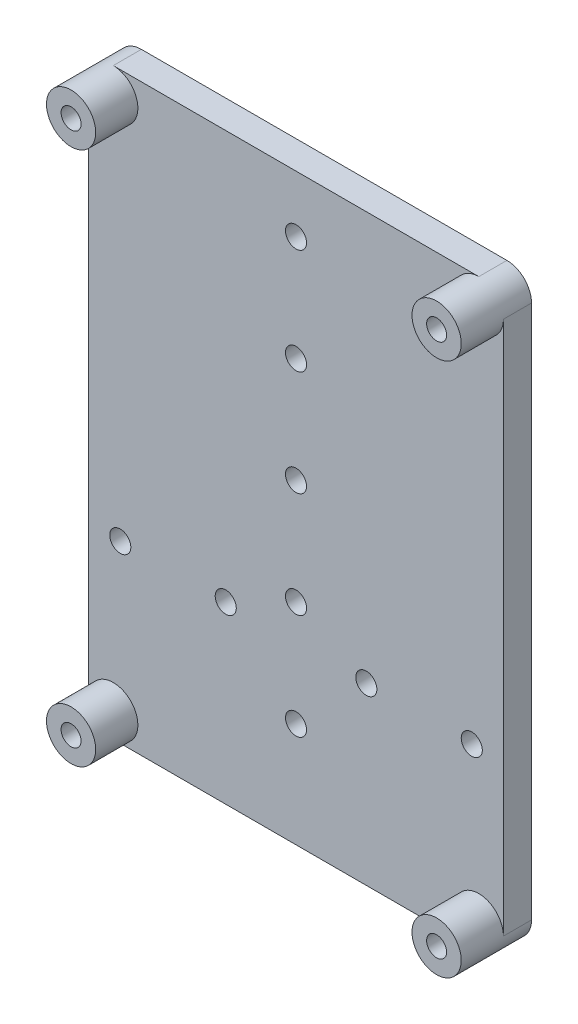
ISO-10303-21;
HEADER;
FILE_DESCRIPTION(('STEP AP214'),'2;1');
FILE_NAME('part.step','',(''),(''),'','','');
FILE_SCHEMA(('AUTOMOTIVE_DESIGN { 1 0 10303 214 1 1 1 1 }'));
ENDSEC;
DATA;
#1=APPLICATION_CONTEXT('core data for automotive mechanical design processes');
#2=APPLICATION_PROTOCOL_DEFINITION('international standard','automotive_design',2000,#1);
#3=PRODUCT_CONTEXT('',#1,'mechanical');
#4=PRODUCT('Part','Part','',(#3));
#5=PRODUCT_RELATED_PRODUCT_CATEGORY('part','',(#4));
#6=PRODUCT_DEFINITION_FORMATION('','',#4);
#7=PRODUCT_DEFINITION_CONTEXT('part definition',#1,'design');
#8=PRODUCT_DEFINITION('design','',#6,#7);
#9=PRODUCT_DEFINITION_SHAPE('','',#8);
#10=(LENGTH_UNIT() NAMED_UNIT(*) SI_UNIT(.MILLI.,.METRE.));
#11=(NAMED_UNIT(*) PLANE_ANGLE_UNIT() SI_UNIT($,.RADIAN.));
#12=(NAMED_UNIT(*) SI_UNIT($,.STERADIAN.) SOLID_ANGLE_UNIT());
#13=UNCERTAINTY_MEASURE_WITH_UNIT(LENGTH_MEASURE(1.E-05),#10,'distance_accuracy_value','');
#14=(GEOMETRIC_REPRESENTATION_CONTEXT(3) GLOBAL_UNCERTAINTY_ASSIGNED_CONTEXT((#13)) GLOBAL_UNIT_ASSIGNED_CONTEXT((#10,
#11,#12)) REPRESENTATION_CONTEXT('',''));
#15=CARTESIAN_POINT('',(0.,0.,0.));
#16=DIRECTION('',(0.,0.,1.));
#17=DIRECTION('',(1.,0.,0.));
#18=AXIS2_PLACEMENT_3D('',#15,#16,#17);
#19=CARTESIAN_POINT('',(108.526557276723,189.230165260636,193.266714262562));
#20=DIRECTION('',(0.,0.,1.));
#21=DIRECTION('',(1.,0.,0.));
#22=AXIS2_PLACEMENT_3D('',#19,#20,#21);
#23=PLANE('',#22);
#24=DIRECTION('',(0.,1.,0.));
#25=VECTOR('',#24,1.);
#26=CARTESIAN_POINT('',(105.026557276723,189.230165260636,193.266714262562));
#27=LINE('',#26,#25);
#28=CARTESIAN_POINT('',(105.026557276723,189.230165260636,193.266714262562));
#29=VERTEX_POINT('',#28);
#30=CARTESIAN_POINT('',(105.026557276723,113.230165260636,193.266714262562));
#31=VERTEX_POINT('',#30);
#32=EDGE_CURVE('E120',#29,#31,#27,.F.);
#33=ORIENTED_EDGE('',*,*,#32,.T.);
#34=CARTESIAN_POINT('',(108.526557276723,113.230165260636,193.266714262562));
#35=DIRECTION('',(0.,0.,-1.));
#36=DIRECTION('',(-1.,0.,0.));
#37=AXIS2_PLACEMENT_3D('',#34,#35,#36);
#38=CIRCLE('',#37,3.50000000000002);
#39=CARTESIAN_POINT('',(108.526557276723,109.730165260636,193.266714262562));
#40=VERTEX_POINT('',#39);
#41=EDGE_CURVE('E117',#40,#31,#38,.F.);
#42=ORIENTED_EDGE('',*,*,#41,.F.);
#43=DIRECTION('',(-1.,0.,0.));
#44=VECTOR('',#43,1.);
#45=CARTESIAN_POINT('',(108.526557276723,109.730165260636,193.266714262562));
#46=LINE('',#45,#44);
#47=CARTESIAN_POINT('',(160.526557276723,109.730165260636,193.266714262562));
#48=VERTEX_POINT('',#47);
#49=EDGE_CURVE('E90',#40,#48,#46,.F.);
#50=ORIENTED_EDGE('',*,*,#49,.T.);
#51=CARTESIAN_POINT('',(160.526557276723,113.230165260636,193.266714262562));
#52=DIRECTION('',(0.,0.,-1.));
#53=DIRECTION('',(-1.,0.,0.));
#54=AXIS2_PLACEMENT_3D('',#51,#52,#53);
#55=CIRCLE('',#54,3.5);
#56=CARTESIAN_POINT('',(164.026557276723,113.230165260636,193.266714262562));
#57=VERTEX_POINT('',#56);
#58=EDGE_CURVE('E83',#57,#48,#55,.F.);
#59=ORIENTED_EDGE('',*,*,#58,.F.);
#60=DIRECTION('',(0.,-1.,0.));
#61=VECTOR('',#60,1.);
#62=CARTESIAN_POINT('',(164.026557276723,113.230165260636,193.266714262562));
#63=LINE('',#62,#61);
#64=CARTESIAN_POINT('',(164.026557276723,189.230165260636,193.266714262562));
#65=VERTEX_POINT('',#64);
#66=EDGE_CURVE('E87',#57,#65,#63,.F.);
#67=ORIENTED_EDGE('',*,*,#66,.T.);
#68=CARTESIAN_POINT('',(160.526557276723,189.230165260636,193.266714262562));
#69=DIRECTION('',(0.,0.,-1.));
#70=DIRECTION('',(-1.,0.,0.));
#71=AXIS2_PLACEMENT_3D('',#68,#69,#70);
#72=CIRCLE('',#71,3.5);
#73=CARTESIAN_POINT('',(160.526557276723,192.730165260636,193.266714262562));
#74=VERTEX_POINT('',#73);
#75=EDGE_CURVE('E78',#74,#65,#72,.F.);
#76=ORIENTED_EDGE('',*,*,#75,.F.);
#77=DIRECTION('',(1.,0.,0.));
#78=VECTOR('',#77,1.);
#79=CARTESIAN_POINT('',(160.526557276723,192.730165260636,193.266714262562));
#80=LINE('',#79,#78);
#81=CARTESIAN_POINT('',(108.526557276723,192.730165260636,193.266714262562));
#82=VERTEX_POINT('',#81);
#83=EDGE_CURVE('E122',#74,#82,#80,.F.);
#84=ORIENTED_EDGE('',*,*,#83,.T.);
#85=CARTESIAN_POINT('',(108.526557276723,189.230165260636,193.266714262562));
#86=DIRECTION('',(0.,0.,-1.));
#87=DIRECTION('',(-1.,0.,0.));
#88=AXIS2_PLACEMENT_3D('',#85,#86,#87);
#89=CIRCLE('',#88,3.5);
#90=EDGE_CURVE('E216',#29,#82,#89,.F.);
#91=ORIENTED_EDGE('',*,*,#90,.F.);
#92=EDGE_LOOP('',(#33,#42,#50,#59,#67,#76,#84,#91));
#93=FACE_BOUND('',#92,.T.);
#94=CARTESIAN_POINT('',(134.526557276723,169.637085274738,193.266714262562));
#95=DIRECTION('',(0.,0.,-1.));
#96=DIRECTION('',(-1.,0.,0.));
#97=AXIS2_PLACEMENT_3D('',#94,#95,#96);
#98=CIRCLE('',#97,1.5);
#99=CARTESIAN_POINT('',(133.026557276723,169.637085274738,193.266714262562));
#100=VERTEX_POINT('',#99);
#101=EDGE_CURVE('E191',#100,#100,#98,.T.);
#102=ORIENTED_EDGE('',*,*,#101,.T.);
#103=EDGE_LOOP('',(#102));
#104=FACE_BOUND('',#103,.T.);
#105=CARTESIAN_POINT('',(134.526557276723,139.637085274738,193.266714262562));
#106=DIRECTION('',(0.,0.,-1.));
#107=DIRECTION('',(-1.,0.,0.));
#108=AXIS2_PLACEMENT_3D('',#105,#106,#107);
#109=CIRCLE('',#108,1.5);
#110=CARTESIAN_POINT('',(133.026557276723,139.637085274738,193.266714262562));
#111=VERTEX_POINT('',#110);
#112=EDGE_CURVE('E197',#111,#111,#109,.T.);
#113=ORIENTED_EDGE('',*,*,#112,.T.);
#114=EDGE_LOOP('',(#113));
#115=FACE_BOUND('',#114,.T.);
#116=CARTESIAN_POINT('',(159.526557276723,134.637085274738,193.266714262562));
#117=DIRECTION('',(0.,0.,-1.));
#118=DIRECTION('',(-1.,0.,0.));
#119=AXIS2_PLACEMENT_3D('',#116,#117,#118);
#120=CIRCLE('',#119,1.49999999999997);
#121=CARTESIAN_POINT('',(158.026557276723,134.637085274738,193.266714262562));
#122=VERTEX_POINT('',#121);
#123=EDGE_CURVE('E203',#122,#122,#120,.T.);
#124=ORIENTED_EDGE('',*,*,#123,.T.);
#125=EDGE_LOOP('',(#124));
#126=FACE_BOUND('',#125,.T.);
#127=CARTESIAN_POINT('',(109.526557276723,134.637085274738,193.266714262562));
#128=DIRECTION('',(0.,0.,-1.));
#129=DIRECTION('',(-1.,0.,0.));
#130=AXIS2_PLACEMENT_3D('',#127,#128,#129);
#131=CIRCLE('',#130,1.5);
#132=CARTESIAN_POINT('',(108.026557276723,134.637085274738,193.266714262562));
#133=VERTEX_POINT('',#132);
#134=EDGE_CURVE('E209',#133,#133,#131,.T.);
#135=ORIENTED_EDGE('',*,*,#134,.T.);
#136=EDGE_LOOP('',(#135));
#137=FACE_BOUND('',#136,.T.);
#138=CARTESIAN_POINT('',(134.526557276723,124.637085274738,193.266714262562));
#139=DIRECTION('',(0.,0.,-1.));
#140=DIRECTION('',(-1.,0.,0.));
#141=AXIS2_PLACEMENT_3D('',#138,#139,#140);
#142=CIRCLE('',#141,1.5);
#143=CARTESIAN_POINT('',(133.026557276723,124.637085274738,193.266714262562));
#144=VERTEX_POINT('',#143);
#145=EDGE_CURVE('E212',#144,#144,#142,.T.);
#146=ORIENTED_EDGE('',*,*,#145,.T.);
#147=EDGE_LOOP('',(#146));
#148=FACE_BOUND('',#147,.T.);
#149=CARTESIAN_POINT('',(124.526557276723,134.637085274738,193.266714262562));
#150=DIRECTION('',(0.,0.,-1.));
#151=DIRECTION('',(-1.,0.,0.));
#152=AXIS2_PLACEMENT_3D('',#149,#150,#151);
#153=CIRCLE('',#152,1.49999999999999);
#154=CARTESIAN_POINT('',(123.026557276723,134.637085274738,193.266714262562));
#155=VERTEX_POINT('',#154);
#156=EDGE_CURVE('E206',#155,#155,#153,.T.);
#157=ORIENTED_EDGE('',*,*,#156,.T.);
#158=EDGE_LOOP('',(#157));
#159=FACE_BOUND('',#158,.T.);
#160=CARTESIAN_POINT('',(144.526557276723,134.637085274738,193.266714262562));
#161=DIRECTION('',(0.,0.,-1.));
#162=DIRECTION('',(-1.,0.,0.));
#163=AXIS2_PLACEMENT_3D('',#160,#161,#162);
#164=CIRCLE('',#163,1.5);
#165=CARTESIAN_POINT('',(143.026557276723,134.637085274738,193.266714262562));
#166=VERTEX_POINT('',#165);
#167=EDGE_CURVE('E200',#166,#166,#164,.T.);
#168=ORIENTED_EDGE('',*,*,#167,.T.);
#169=EDGE_LOOP('',(#168));
#170=FACE_BOUND('',#169,.T.);
#171=CARTESIAN_POINT('',(134.526557276723,154.637085274738,193.266714262562));
#172=DIRECTION('',(0.,0.,-1.));
#173=DIRECTION('',(-1.,0.,0.));
#174=AXIS2_PLACEMENT_3D('',#171,#172,#173);
#175=CIRCLE('',#174,1.5);
#176=CARTESIAN_POINT('',(133.026557276723,154.637085274738,193.266714262562));
#177=VERTEX_POINT('',#176);
#178=EDGE_CURVE('E194',#177,#177,#175,.T.);
#179=ORIENTED_EDGE('',*,*,#178,.T.);
#180=EDGE_LOOP('',(#179));
#181=FACE_BOUND('',#180,.T.);
#182=CARTESIAN_POINT('',(134.526557276723,184.637085274738,193.266714262562));
#183=DIRECTION('',(0.,0.,-1.));
#184=DIRECTION('',(-1.,0.,0.));
#185=AXIS2_PLACEMENT_3D('',#182,#183,#184);
#186=CIRCLE('',#185,1.5);
#187=CARTESIAN_POINT('',(133.026557276723,184.637085274738,193.266714262562));
#188=VERTEX_POINT('',#187);
#189=EDGE_CURVE('E188',#188,#188,#186,.T.);
#190=ORIENTED_EDGE('',*,*,#189,.T.);
#191=EDGE_LOOP('',(#190));
#192=FACE_BOUND('',#191,.T.);
#193=ADVANCED_FACE('F17',(#93,#104,#115,#126,#137,#148,#159,#170,#181,#192),#23,.T.);
#194=CARTESIAN_POINT('',(108.526557276723,189.230165260636,199.266714262562));
#195=DIRECTION('',(0.,0.,1.));
#196=DIRECTION('',(1.,0.,0.));
#197=AXIS2_PLACEMENT_3D('',#194,#195,#196);
#198=PLANE('',#197);
#199=CARTESIAN_POINT('',(108.526557276723,189.230165260636,199.266714262562));
#200=DIRECTION('',(0.,0.,-1.));
#201=DIRECTION('',(-1.,0.,0.));
#202=AXIS2_PLACEMENT_3D('',#199,#200,#201);
#203=CIRCLE('',#202,1.4224);
#204=CARTESIAN_POINT('',(107.104157276723,189.230165260636,199.266714262562));
#205=VERTEX_POINT('',#204);
#206=EDGE_CURVE('E185',#205,#205,#203,.T.);
#207=ORIENTED_EDGE('',*,*,#206,.T.);
#208=EDGE_LOOP('',(#207));
#209=FACE_BOUND('',#208,.T.);
#210=CARTESIAN_POINT('',(108.526557276723,189.230165260636,199.266714262562));
#211=DIRECTION('',(0.,0.,-1.));
#212=DIRECTION('',(-1.,0.,0.));
#213=AXIS2_PLACEMENT_3D('',#210,#211,#212);
#214=CIRCLE('',#213,3.5);
#215=CARTESIAN_POINT('',(105.026557276723,189.230165260636,199.266714262562));
#216=VERTEX_POINT('',#215);
#217=EDGE_CURVE('E124',#216,#216,#214,.T.);
#218=ORIENTED_EDGE('',*,*,#217,.F.);
#219=EDGE_LOOP('',(#218));
#220=FACE_BOUND('',#219,.T.);
#221=ADVANCED_FACE('F493',(#209,#220),#198,.T.);
#222=CARTESIAN_POINT('',(160.526557276723,189.230165260636,199.266714262562));
#223=DIRECTION('',(0.,0.,1.));
#224=DIRECTION('',(1.,0.,0.));
#225=AXIS2_PLACEMENT_3D('',#222,#223,#224);
#226=PLANE('',#225);
#227=CARTESIAN_POINT('',(160.526557276723,189.230165260636,199.266714262562));
#228=DIRECTION('',(0.,0.,-1.));
#229=DIRECTION('',(-1.,0.,0.));
#230=AXIS2_PLACEMENT_3D('',#227,#228,#229);
#231=CIRCLE('',#230,1.42240000000002);
#232=CARTESIAN_POINT('',(159.104157276723,189.230165260636,199.266714262562));
#233=VERTEX_POINT('',#232);
#234=EDGE_CURVE('E182',#233,#233,#231,.T.);
#235=ORIENTED_EDGE('',*,*,#234,.T.);
#236=EDGE_LOOP('',(#235));
#237=FACE_BOUND('',#236,.T.);
#238=CARTESIAN_POINT('',(160.526557276723,189.230165260636,199.266714262562));
#239=DIRECTION('',(0.,0.,-1.));
#240=DIRECTION('',(-1.,0.,0.));
#241=AXIS2_PLACEMENT_3D('',#238,#239,#240);
#242=CIRCLE('',#241,3.5);
#243=CARTESIAN_POINT('',(157.026557276723,189.230165260636,199.266714262562));
#244=VERTEX_POINT('',#243);
#245=EDGE_CURVE('E103',#244,#244,#242,.T.);
#246=ORIENTED_EDGE('',*,*,#245,.F.);
#247=EDGE_LOOP('',(#246));
#248=FACE_BOUND('',#247,.T.);
#249=ADVANCED_FACE('F484',(#237,#248),#226,.T.);
#250=CARTESIAN_POINT('',(160.526557276723,113.230165260636,199.266714262562));
#251=DIRECTION('',(0.,0.,1.));
#252=DIRECTION('',(1.,0.,0.));
#253=AXIS2_PLACEMENT_3D('',#250,#251,#252);
#254=PLANE('',#253);
#255=CARTESIAN_POINT('',(160.526557276723,113.230165260636,199.266714262562));
#256=DIRECTION('',(0.,0.,-1.));
#257=DIRECTION('',(-1.,0.,0.));
#258=AXIS2_PLACEMENT_3D('',#255,#256,#257);
#259=CIRCLE('',#258,1.42240000000002);
#260=CARTESIAN_POINT('',(159.104157276723,113.230165260636,199.266714262562));
#261=VERTEX_POINT('',#260);
#262=EDGE_CURVE('E179',#261,#261,#259,.T.);
#263=ORIENTED_EDGE('',*,*,#262,.T.);
#264=EDGE_LOOP('',(#263));
#265=FACE_BOUND('',#264,.T.);
#266=CARTESIAN_POINT('',(160.526557276723,113.230165260636,199.266714262562));
#267=DIRECTION('',(0.,0.,-1.));
#268=DIRECTION('',(-1.,0.,0.));
#269=AXIS2_PLACEMENT_3D('',#266,#267,#268);
#270=CIRCLE('',#269,3.5);
#271=CARTESIAN_POINT('',(157.026557276723,113.230165260636,199.266714262562));
#272=VERTEX_POINT('',#271);
#273=EDGE_CURVE('E95',#272,#272,#270,.T.);
#274=ORIENTED_EDGE('',*,*,#273,.F.);
#275=EDGE_LOOP('',(#274));
#276=FACE_BOUND('',#275,.T.);
#277=ADVANCED_FACE('F475',(#265,#276),#254,.T.);
#278=CARTESIAN_POINT('',(108.526557276723,113.230165260636,199.266714262562));
#279=DIRECTION('',(0.,0.,1.));
#280=DIRECTION('',(1.,0.,0.));
#281=AXIS2_PLACEMENT_3D('',#278,#279,#280);
#282=PLANE('',#281);
#283=CARTESIAN_POINT('',(108.526557276723,113.230165260636,199.266714262562));
#284=DIRECTION('',(0.,0.,-1.));
#285=DIRECTION('',(-1.,0.,0.));
#286=AXIS2_PLACEMENT_3D('',#283,#284,#285);
#287=CIRCLE('',#286,1.42239999999999);
#288=CARTESIAN_POINT('',(107.104157276723,113.230165260636,199.266714262562));
#289=VERTEX_POINT('',#288);
#290=EDGE_CURVE('E176',#289,#289,#287,.T.);
#291=ORIENTED_EDGE('',*,*,#290,.T.);
#292=EDGE_LOOP('',(#291));
#293=FACE_BOUND('',#292,.T.);
#294=CARTESIAN_POINT('',(108.526557276723,113.230165260636,199.266714262562));
#295=DIRECTION('',(0.,0.,-1.));
#296=DIRECTION('',(-1.,0.,0.));
#297=AXIS2_PLACEMENT_3D('',#294,#295,#296);
#298=CIRCLE('',#297,3.50000000000002);
#299=CARTESIAN_POINT('',(105.026557276723,113.230165260636,199.266714262562));
#300=VERTEX_POINT('',#299);
#301=EDGE_CURVE('E20',#300,#300,#298,.T.);
#302=ORIENTED_EDGE('',*,*,#301,.F.);
#303=EDGE_LOOP('',(#302));
#304=FACE_BOUND('',#303,.T.);
#305=ADVANCED_FACE('F467',(#293,#304),#282,.T.);
#306=CARTESIAN_POINT('',(105.026557276723,189.230165260636,193.266714262562));
#307=DIRECTION('',(1.,0.,0.));
#308=DIRECTION('',(0.,1.,0.));
#309=AXIS2_PLACEMENT_3D('',#306,#307,#308);
#310=PLANE('',#309);
#311=DIRECTION('',(0.,0.,-1.));
#312=VECTOR('',#311,1.);
#313=CARTESIAN_POINT('',(105.026557276723,113.230165260636,193.266714262562));
#314=LINE('',#313,#312);
#315=CARTESIAN_POINT('',(105.026557276723,113.230165260636,189.266714262562));
#316=VERTEX_POINT('',#315);
#317=EDGE_CURVE('E118',#31,#316,#314,.T.);
#318=ORIENTED_EDGE('',*,*,#317,.F.);
#319=ORIENTED_EDGE('',*,*,#32,.F.);
#320=DIRECTION('',(0.,0.,-1.));
#321=VECTOR('',#320,1.);
#322=CARTESIAN_POINT('',(105.026557276723,189.230165260636,193.266714262562));
#323=LINE('',#322,#321);
#324=CARTESIAN_POINT('',(105.026557276723,189.230165260636,189.266714262562));
#325=VERTEX_POINT('',#324);
#326=EDGE_CURVE('E215',#325,#29,#323,.F.);
#327=ORIENTED_EDGE('',*,*,#326,.F.);
#328=DIRECTION('',(0.,1.,0.));
#329=VECTOR('',#328,1.);
#330=CARTESIAN_POINT('',(105.026557276723,189.230165260636,189.266714262562));
#331=LINE('',#330,#329);
#332=EDGE_CURVE('E175',#325,#316,#331,.F.);
#333=ORIENTED_EDGE('',*,*,#332,.T.);
#334=EDGE_LOOP('',(#318,#319,#327,#333));
#335=FACE_BOUND('',#334,.T.);
#336=ADVANCED_FACE('F233',(#335),#310,.F.);
#337=CARTESIAN_POINT('',(108.526557276723,113.230165260636,193.266714262562));
#338=DIRECTION('',(0.,0.,-1.));
#339=DIRECTION('',(-1.,0.,0.));
#340=AXIS2_PLACEMENT_3D('',#337,#338,#339);
#341=CYLINDRICAL_SURFACE('',#340,3.50000000000002);
#342=ORIENTED_EDGE('',*,*,#301,.T.);
#343=EDGE_LOOP('',(#342));
#344=FACE_BOUND('',#343,.T.);
#345=DIRECTION('',(0.,0.,1.));
#346=VECTOR('',#345,1.);
#347=CARTESIAN_POINT('',(108.526557276723,109.730165260636,193.266714262562));
#348=LINE('',#347,#346);
#349=CARTESIAN_POINT('',(108.526557276723,109.730165260636,189.266714262562));
#350=VERTEX_POINT('',#349);
#351=EDGE_CURVE('E114',#350,#40,#348,.T.);
#352=ORIENTED_EDGE('',*,*,#351,.T.);
#353=ORIENTED_EDGE('',*,*,#41,.T.);
#354=ORIENTED_EDGE('',*,*,#317,.T.);
#355=CARTESIAN_POINT('',(108.526557276723,113.230165260636,189.266714262562));
#356=DIRECTION('',(0.,0.,-1.));
#357=DIRECTION('',(-1.,0.,0.));
#358=AXIS2_PLACEMENT_3D('',#355,#356,#357);
#359=CIRCLE('',#358,3.50000000000002);
#360=EDGE_CURVE('E172',#316,#350,#359,.F.);
#361=ORIENTED_EDGE('',*,*,#360,.T.);
#362=EDGE_LOOP('',(#352,#353,#354,#361));
#363=FACE_BOUND('',#362,.T.);
#364=ADVANCED_FACE('F225',(#344,#363),#341,.T.);
#365=CARTESIAN_POINT('',(108.526557276723,109.730165260636,193.266714262562));
#366=DIRECTION('',(0.,1.,0.));
#367=DIRECTION('',(-1.,0.,0.));
#368=AXIS2_PLACEMENT_3D('',#365,#366,#367);
#369=PLANE('',#368);
#370=DIRECTION('',(0.,0.,-1.));
#371=VECTOR('',#370,1.);
#372=CARTESIAN_POINT('',(160.526557276723,109.730165260636,193.266714262562));
#373=LINE('',#372,#371);
#374=CARTESIAN_POINT('',(160.526557276723,109.730165260636,189.266714262562));
#375=VERTEX_POINT('',#374);
#376=EDGE_CURVE('E94',#48,#375,#373,.T.);
#377=ORIENTED_EDGE('',*,*,#376,.F.);
#378=ORIENTED_EDGE('',*,*,#49,.F.);
#379=ORIENTED_EDGE('',*,*,#351,.F.);
#380=DIRECTION('',(1.,0.,0.));
#381=VECTOR('',#380,1.);
#382=CARTESIAN_POINT('',(108.526557276723,109.730165260636,189.266714262562));
#383=LINE('',#382,#381);
#384=EDGE_CURVE('E171',#350,#375,#383,.T.);
#385=ORIENTED_EDGE('',*,*,#384,.T.);
#386=EDGE_LOOP('',(#377,#378,#379,#385));
#387=FACE_BOUND('',#386,.T.);
#388=ADVANCED_FACE('F253',(#387),#369,.F.);
#389=CARTESIAN_POINT('',(160.526557276723,113.230165260636,193.266714262562));
#390=DIRECTION('',(0.,0.,-1.));
#391=DIRECTION('',(-1.,0.,0.));
#392=AXIS2_PLACEMENT_3D('',#389,#390,#391);
#393=CYLINDRICAL_SURFACE('',#392,3.5);
#394=ORIENTED_EDGE('',*,*,#273,.T.);
#395=EDGE_LOOP('',(#394));
#396=FACE_BOUND('',#395,.T.);
#397=CARTESIAN_POINT('',(160.526557276723,113.230165260636,189.266714262562));
#398=DIRECTION('',(0.,0.,-1.));
#399=DIRECTION('',(-1.,0.,0.));
#400=AXIS2_PLACEMENT_3D('',#397,#398,#399);
#401=CIRCLE('',#400,3.5);
#402=CARTESIAN_POINT('',(164.026557276723,113.230165260636,189.266714262562));
#403=VERTEX_POINT('',#402);
#404=EDGE_CURVE('E108',#375,#403,#401,.F.);
#405=ORIENTED_EDGE('',*,*,#404,.T.);
#406=DIRECTION('',(0.,0.,1.));
#407=VECTOR('',#406,1.);
#408=CARTESIAN_POINT('',(164.026557276723,113.230165260636,193.266714262562));
#409=LINE('',#408,#407);
#410=EDGE_CURVE('E100',#403,#57,#409,.T.);
#411=ORIENTED_EDGE('',*,*,#410,.T.);
#412=ORIENTED_EDGE('',*,*,#58,.T.);
#413=ORIENTED_EDGE('',*,*,#376,.T.);
#414=EDGE_LOOP('',(#405,#411,#412,#413));
#415=FACE_BOUND('',#414,.T.);
#416=ADVANCED_FACE('F106',(#396,#415),#393,.T.);
#417=CARTESIAN_POINT('',(164.026557276723,113.230165260636,193.266714262562));
#418=DIRECTION('',(-1.,0.,0.));
#419=DIRECTION('',(0.,-1.,0.));
#420=AXIS2_PLACEMENT_3D('',#417,#418,#419);
#421=PLANE('',#420);
#422=DIRECTION('',(0.,0.,-1.));
#423=VECTOR('',#422,1.);
#424=CARTESIAN_POINT('',(164.026557276723,189.230165260636,193.266714262562));
#425=LINE('',#424,#423);
#426=CARTESIAN_POINT('',(164.026557276723,189.230165260636,189.266714262562));
#427=VERTEX_POINT('',#426);
#428=EDGE_CURVE('E102',#65,#427,#425,.T.);
#429=ORIENTED_EDGE('',*,*,#428,.F.);
#430=ORIENTED_EDGE('',*,*,#66,.F.);
#431=ORIENTED_EDGE('',*,*,#410,.F.);
#432=DIRECTION('',(0.,1.,0.));
#433=VECTOR('',#432,1.);
#434=CARTESIAN_POINT('',(164.026557276723,189.230165260636,189.266714262562));
#435=LINE('',#434,#433);
#436=EDGE_CURVE('E169',#403,#427,#435,.T.);
#437=ORIENTED_EDGE('',*,*,#436,.T.);
#438=EDGE_LOOP('',(#429,#430,#431,#437));
#439=FACE_BOUND('',#438,.T.);
#440=ADVANCED_FACE('F98',(#439),#421,.F.);
#441=CARTESIAN_POINT('',(160.526557276723,189.230165260636,193.266714262562));
#442=DIRECTION('',(0.,0.,-1.));
#443=DIRECTION('',(-1.,0.,0.));
#444=AXIS2_PLACEMENT_3D('',#441,#442,#443);
#445=CYLINDRICAL_SURFACE('',#444,3.5);
#446=ORIENTED_EDGE('',*,*,#75,.T.);
#447=ORIENTED_EDGE('',*,*,#428,.T.);
#448=CARTESIAN_POINT('',(160.526557276723,189.230165260636,189.266714262562));
#449=DIRECTION('',(0.,0.,-1.));
#450=DIRECTION('',(-1.,0.,0.));
#451=AXIS2_PLACEMENT_3D('',#448,#449,#450);
#452=CIRCLE('',#451,3.5);
#453=CARTESIAN_POINT('',(160.526557276723,192.730165260636,189.266714262562));
#454=VERTEX_POINT('',#453);
#455=EDGE_CURVE('E166',#427,#454,#452,.F.);
#456=ORIENTED_EDGE('',*,*,#455,.T.);
#457=DIRECTION('',(0.,0.,-1.));
#458=VECTOR('',#457,1.);
#459=CARTESIAN_POINT('',(160.526557276723,192.730165260636,193.266714262562));
#460=LINE('',#459,#458);
#461=EDGE_CURVE('E125',#454,#74,#460,.F.);
#462=ORIENTED_EDGE('',*,*,#461,.T.);
#463=EDGE_LOOP('',(#446,#447,#456,#462));
#464=FACE_BOUND('',#463,.T.);
#465=ORIENTED_EDGE('',*,*,#245,.T.);
#466=EDGE_LOOP('',(#465));
#467=FACE_BOUND('',#466,.T.);
#468=ADVANCED_FACE('F240',(#464,#467),#445,.T.);
#469=CARTESIAN_POINT('',(160.526557276723,192.730165260636,193.266714262562));
#470=DIRECTION('',(0.,-1.,0.));
#471=DIRECTION('',(0.,0.,-1.));
#472=AXIS2_PLACEMENT_3D('',#469,#470,#471);
#473=PLANE('',#472);
#474=DIRECTION('',(0.,0.,-1.));
#475=VECTOR('',#474,1.);
#476=CARTESIAN_POINT('',(108.526557276723,192.730165260636,193.266714262562));
#477=LINE('',#476,#475);
#478=CARTESIAN_POINT('',(108.526557276723,192.730165260636,189.266714262562));
#479=VERTEX_POINT('',#478);
#480=EDGE_CURVE('E35',#82,#479,#477,.T.);
#481=ORIENTED_EDGE('',*,*,#480,.F.);
#482=ORIENTED_EDGE('',*,*,#83,.F.);
#483=ORIENTED_EDGE('',*,*,#461,.F.);
#484=DIRECTION('',(1.,0.,0.));
#485=VECTOR('',#484,1.);
#486=CARTESIAN_POINT('',(108.526557276723,192.730165260636,189.266714262562));
#487=LINE('',#486,#485);
#488=EDGE_CURVE('E165',#454,#479,#487,.F.);
#489=ORIENTED_EDGE('',*,*,#488,.T.);
#490=EDGE_LOOP('',(#481,#482,#483,#489));
#491=FACE_BOUND('',#490,.T.);
#492=ADVANCED_FACE('F247',(#491),#473,.F.);
#493=CARTESIAN_POINT('',(108.526557276723,189.230165260636,193.266714262562));
#494=DIRECTION('',(0.,0.,-1.));
#495=DIRECTION('',(-1.,0.,0.));
#496=AXIS2_PLACEMENT_3D('',#493,#494,#495);
#497=CYLINDRICAL_SURFACE('',#496,3.5);
#498=ORIENTED_EDGE('',*,*,#326,.T.);
#499=ORIENTED_EDGE('',*,*,#90,.T.);
#500=ORIENTED_EDGE('',*,*,#480,.T.);
#501=CARTESIAN_POINT('',(108.526557276723,189.230165260636,189.266714262562));
#502=DIRECTION('',(0.,0.,-1.));
#503=DIRECTION('',(-1.,0.,0.));
#504=AXIS2_PLACEMENT_3D('',#501,#502,#503);
#505=CIRCLE('',#504,3.5);
#506=EDGE_CURVE('E163',#479,#325,#505,.F.);
#507=ORIENTED_EDGE('',*,*,#506,.T.);
#508=EDGE_LOOP('',(#498,#499,#500,#507));
#509=FACE_BOUND('',#508,.T.);
#510=ORIENTED_EDGE('',*,*,#217,.T.);
#511=EDGE_LOOP('',(#510));
#512=FACE_BOUND('',#511,.T.);
#513=ADVANCED_FACE('F324',(#509,#512),#497,.T.);
#514=CARTESIAN_POINT('',(134.526557276723,124.637085274738,193.266714262562));
#515=DIRECTION('',(0.,0.,-1.));
#516=DIRECTION('',(-1.,0.,0.));
#517=AXIS2_PLACEMENT_3D('',#514,#515,#516);
#518=CYLINDRICAL_SURFACE('',#517,1.5);
#519=CARTESIAN_POINT('',(134.526557276723,124.637085274738,189.266714262562));
#520=DIRECTION('',(0.,0.,-1.));
#521=DIRECTION('',(-1.,0.,0.));
#522=AXIS2_PLACEMENT_3D('',#519,#520,#521);
#523=CIRCLE('',#522,1.5);
#524=CARTESIAN_POINT('',(133.026557276723,124.637085274738,189.266714262562));
#525=VERTEX_POINT('',#524);
#526=EDGE_CURVE('E160',#525,#525,#523,.T.);
#527=ORIENTED_EDGE('',*,*,#526,.T.);
#528=EDGE_LOOP('',(#527));
#529=FACE_BOUND('',#528,.T.);
#530=ORIENTED_EDGE('',*,*,#145,.F.);
#531=EDGE_LOOP('',(#530));
#532=FACE_BOUND('',#531,.T.);
#533=ADVANCED_FACE('F320',(#529,#532),#518,.F.);
#534=CARTESIAN_POINT('',(109.526557276723,134.637085274738,193.266714262562));
#535=DIRECTION('',(0.,0.,-1.));
#536=DIRECTION('',(-1.,0.,0.));
#537=AXIS2_PLACEMENT_3D('',#534,#535,#536);
#538=CYLINDRICAL_SURFACE('',#537,1.5);
#539=CARTESIAN_POINT('',(109.526557276723,134.637085274738,189.266714262562));
#540=DIRECTION('',(0.,0.,-1.));
#541=DIRECTION('',(-1.,0.,0.));
#542=AXIS2_PLACEMENT_3D('',#539,#540,#541);
#543=CIRCLE('',#542,1.5);
#544=CARTESIAN_POINT('',(108.026557276723,134.637085274738,189.266714262562));
#545=VERTEX_POINT('',#544);
#546=EDGE_CURVE('E157',#545,#545,#543,.T.);
#547=ORIENTED_EDGE('',*,*,#546,.T.);
#548=EDGE_LOOP('',(#547));
#549=FACE_BOUND('',#548,.T.);
#550=ORIENTED_EDGE('',*,*,#134,.F.);
#551=EDGE_LOOP('',(#550));
#552=FACE_BOUND('',#551,.T.);
#553=ADVANCED_FACE('F316',(#549,#552),#538,.F.);
#554=CARTESIAN_POINT('',(124.526557276723,134.637085274738,193.266714262562));
#555=DIRECTION('',(0.,0.,-1.));
#556=DIRECTION('',(-1.,0.,0.));
#557=AXIS2_PLACEMENT_3D('',#554,#555,#556);
#558=CYLINDRICAL_SURFACE('',#557,1.49999999999999);
#559=CARTESIAN_POINT('',(124.526557276723,134.637085274738,189.266714262562));
#560=DIRECTION('',(0.,0.,-1.));
#561=DIRECTION('',(-1.,0.,0.));
#562=AXIS2_PLACEMENT_3D('',#559,#560,#561);
#563=CIRCLE('',#562,1.49999999999999);
#564=CARTESIAN_POINT('',(123.026557276723,134.637085274738,189.266714262562));
#565=VERTEX_POINT('',#564);
#566=EDGE_CURVE('E154',#565,#565,#563,.T.);
#567=ORIENTED_EDGE('',*,*,#566,.T.);
#568=EDGE_LOOP('',(#567));
#569=FACE_BOUND('',#568,.T.);
#570=ORIENTED_EDGE('',*,*,#156,.F.);
#571=EDGE_LOOP('',(#570));
#572=FACE_BOUND('',#571,.T.);
#573=ADVANCED_FACE('F312',(#569,#572),#558,.F.);
#574=CARTESIAN_POINT('',(159.526557276723,134.637085274738,193.266714262562));
#575=DIRECTION('',(0.,0.,-1.));
#576=DIRECTION('',(-1.,0.,0.));
#577=AXIS2_PLACEMENT_3D('',#574,#575,#576);
#578=CYLINDRICAL_SURFACE('',#577,1.49999999999997);
#579=CARTESIAN_POINT('',(159.526557276723,134.637085274738,189.266714262562));
#580=DIRECTION('',(0.,0.,-1.));
#581=DIRECTION('',(-1.,0.,0.));
#582=AXIS2_PLACEMENT_3D('',#579,#580,#581);
#583=CIRCLE('',#582,1.49999999999997);
#584=CARTESIAN_POINT('',(158.026557276723,134.637085274738,189.266714262562));
#585=VERTEX_POINT('',#584);
#586=EDGE_CURVE('E151',#585,#585,#583,.T.);
#587=ORIENTED_EDGE('',*,*,#586,.T.);
#588=EDGE_LOOP('',(#587));
#589=FACE_BOUND('',#588,.T.);
#590=ORIENTED_EDGE('',*,*,#123,.F.);
#591=EDGE_LOOP('',(#590));
#592=FACE_BOUND('',#591,.T.);
#593=ADVANCED_FACE('F308',(#589,#592),#578,.F.);
#594=CARTESIAN_POINT('',(144.526557276723,134.637085274738,193.266714262562));
#595=DIRECTION('',(0.,0.,-1.));
#596=DIRECTION('',(-1.,0.,0.));
#597=AXIS2_PLACEMENT_3D('',#594,#595,#596);
#598=CYLINDRICAL_SURFACE('',#597,1.5);
#599=CARTESIAN_POINT('',(144.526557276723,134.637085274738,189.266714262562));
#600=DIRECTION('',(0.,0.,-1.));
#601=DIRECTION('',(-1.,0.,0.));
#602=AXIS2_PLACEMENT_3D('',#599,#600,#601);
#603=CIRCLE('',#602,1.5);
#604=CARTESIAN_POINT('',(143.026557276723,134.637085274738,189.266714262562));
#605=VERTEX_POINT('',#604);
#606=EDGE_CURVE('E148',#605,#605,#603,.T.);
#607=ORIENTED_EDGE('',*,*,#606,.T.);
#608=EDGE_LOOP('',(#607));
#609=FACE_BOUND('',#608,.T.);
#610=ORIENTED_EDGE('',*,*,#167,.F.);
#611=EDGE_LOOP('',(#610));
#612=FACE_BOUND('',#611,.T.);
#613=ADVANCED_FACE('F304',(#609,#612),#598,.F.);
#614=CARTESIAN_POINT('',(134.526557276723,139.637085274738,193.266714262562));
#615=DIRECTION('',(0.,0.,-1.));
#616=DIRECTION('',(-1.,0.,0.));
#617=AXIS2_PLACEMENT_3D('',#614,#615,#616);
#618=CYLINDRICAL_SURFACE('',#617,1.5);
#619=CARTESIAN_POINT('',(134.526557276723,139.637085274738,189.266714262562));
#620=DIRECTION('',(0.,0.,-1.));
#621=DIRECTION('',(-1.,0.,0.));
#622=AXIS2_PLACEMENT_3D('',#619,#620,#621);
#623=CIRCLE('',#622,1.5);
#624=CARTESIAN_POINT('',(133.026557276723,139.637085274738,189.266714262562));
#625=VERTEX_POINT('',#624);
#626=EDGE_CURVE('E145',#625,#625,#623,.T.);
#627=ORIENTED_EDGE('',*,*,#626,.T.);
#628=EDGE_LOOP('',(#627));
#629=FACE_BOUND('',#628,.T.);
#630=ORIENTED_EDGE('',*,*,#112,.F.);
#631=EDGE_LOOP('',(#630));
#632=FACE_BOUND('',#631,.T.);
#633=ADVANCED_FACE('F300',(#629,#632),#618,.F.);
#634=CARTESIAN_POINT('',(134.526557276723,154.637085274738,193.266714262562));
#635=DIRECTION('',(0.,0.,-1.));
#636=DIRECTION('',(-1.,0.,0.));
#637=AXIS2_PLACEMENT_3D('',#634,#635,#636);
#638=CYLINDRICAL_SURFACE('',#637,1.5);
#639=CARTESIAN_POINT('',(134.526557276723,154.637085274738,189.266714262562));
#640=DIRECTION('',(0.,0.,-1.));
#641=DIRECTION('',(-1.,0.,0.));
#642=AXIS2_PLACEMENT_3D('',#639,#640,#641);
#643=CIRCLE('',#642,1.5);
#644=CARTESIAN_POINT('',(133.026557276723,154.637085274738,189.266714262562));
#645=VERTEX_POINT('',#644);
#646=EDGE_CURVE('E142',#645,#645,#643,.T.);
#647=ORIENTED_EDGE('',*,*,#646,.T.);
#648=EDGE_LOOP('',(#647));
#649=FACE_BOUND('',#648,.T.);
#650=ORIENTED_EDGE('',*,*,#178,.F.);
#651=EDGE_LOOP('',(#650));
#652=FACE_BOUND('',#651,.T.);
#653=ADVANCED_FACE('F296',(#649,#652),#638,.F.);
#654=CARTESIAN_POINT('',(134.526557276723,169.637085274738,193.266714262562));
#655=DIRECTION('',(0.,0.,-1.));
#656=DIRECTION('',(-1.,0.,0.));
#657=AXIS2_PLACEMENT_3D('',#654,#655,#656);
#658=CYLINDRICAL_SURFACE('',#657,1.5);
#659=CARTESIAN_POINT('',(134.526557276723,169.637085274738,189.266714262562));
#660=DIRECTION('',(0.,0.,-1.));
#661=DIRECTION('',(-1.,0.,0.));
#662=AXIS2_PLACEMENT_3D('',#659,#660,#661);
#663=CIRCLE('',#662,1.5);
#664=CARTESIAN_POINT('',(133.026557276723,169.637085274738,189.266714262562));
#665=VERTEX_POINT('',#664);
#666=EDGE_CURVE('E139',#665,#665,#663,.T.);
#667=ORIENTED_EDGE('',*,*,#666,.T.);
#668=EDGE_LOOP('',(#667));
#669=FACE_BOUND('',#668,.T.);
#670=ORIENTED_EDGE('',*,*,#101,.F.);
#671=EDGE_LOOP('',(#670));
#672=FACE_BOUND('',#671,.T.);
#673=ADVANCED_FACE('F292',(#669,#672),#658,.F.);
#674=CARTESIAN_POINT('',(134.526557276723,184.637085274738,193.266714262562));
#675=DIRECTION('',(0.,0.,-1.));
#676=DIRECTION('',(-1.,0.,0.));
#677=AXIS2_PLACEMENT_3D('',#674,#675,#676);
#678=CYLINDRICAL_SURFACE('',#677,1.5);
#679=CARTESIAN_POINT('',(134.526557276723,184.637085274738,189.266714262562));
#680=DIRECTION('',(0.,0.,-1.));
#681=DIRECTION('',(-1.,0.,0.));
#682=AXIS2_PLACEMENT_3D('',#679,#680,#681);
#683=CIRCLE('',#682,1.5);
#684=CARTESIAN_POINT('',(133.026557276723,184.637085274738,189.266714262562));
#685=VERTEX_POINT('',#684);
#686=EDGE_CURVE('E136',#685,#685,#683,.T.);
#687=ORIENTED_EDGE('',*,*,#686,.T.);
#688=EDGE_LOOP('',(#687));
#689=FACE_BOUND('',#688,.T.);
#690=ORIENTED_EDGE('',*,*,#189,.F.);
#691=EDGE_LOOP('',(#690));
#692=FACE_BOUND('',#691,.T.);
#693=ADVANCED_FACE('F288',(#689,#692),#678,.F.);
#694=CARTESIAN_POINT('',(108.526557276723,189.230165260636,193.266714262562));
#695=DIRECTION('',(0.,0.,-1.));
#696=DIRECTION('',(-1.,0.,0.));
#697=AXIS2_PLACEMENT_3D('',#694,#695,#696);
#698=CYLINDRICAL_SURFACE('',#697,1.4224);
#699=CARTESIAN_POINT('',(108.526557276723,189.230165260636,189.266714262562));
#700=DIRECTION('',(0.,0.,-1.));
#701=DIRECTION('',(-1.,0.,0.));
#702=AXIS2_PLACEMENT_3D('',#699,#700,#701);
#703=CIRCLE('',#702,1.4224);
#704=CARTESIAN_POINT('',(107.104157276723,189.230165260636,189.266714262562));
#705=VERTEX_POINT('',#704);
#706=EDGE_CURVE('E133',#705,#705,#703,.T.);
#707=ORIENTED_EDGE('',*,*,#706,.T.);
#708=EDGE_LOOP('',(#707));
#709=FACE_BOUND('',#708,.T.);
#710=ORIENTED_EDGE('',*,*,#206,.F.);
#711=EDGE_LOOP('',(#710));
#712=FACE_BOUND('',#711,.T.);
#713=ADVANCED_FACE('F284',(#709,#712),#698,.F.);
#714=CARTESIAN_POINT('',(160.526557276723,189.230165260636,193.266714262562));
#715=DIRECTION('',(0.,0.,-1.));
#716=DIRECTION('',(-1.,0.,0.));
#717=AXIS2_PLACEMENT_3D('',#714,#715,#716);
#718=CYLINDRICAL_SURFACE('',#717,1.42240000000002);
#719=CARTESIAN_POINT('',(160.526557276723,189.230165260636,189.266714262562));
#720=DIRECTION('',(0.,0.,-1.));
#721=DIRECTION('',(-1.,0.,0.));
#722=AXIS2_PLACEMENT_3D('',#719,#720,#721);
#723=CIRCLE('',#722,1.42240000000002);
#724=CARTESIAN_POINT('',(159.104157276723,189.230165260636,189.266714262562));
#725=VERTEX_POINT('',#724);
#726=EDGE_CURVE('E130',#725,#725,#723,.T.);
#727=ORIENTED_EDGE('',*,*,#726,.T.);
#728=EDGE_LOOP('',(#727));
#729=FACE_BOUND('',#728,.T.);
#730=ORIENTED_EDGE('',*,*,#234,.F.);
#731=EDGE_LOOP('',(#730));
#732=FACE_BOUND('',#731,.T.);
#733=ADVANCED_FACE('F280',(#729,#732),#718,.F.);
#734=CARTESIAN_POINT('',(160.526557276723,113.230165260636,193.266714262562));
#735=DIRECTION('',(0.,0.,-1.));
#736=DIRECTION('',(-1.,0.,0.));
#737=AXIS2_PLACEMENT_3D('',#734,#735,#736);
#738=CYLINDRICAL_SURFACE('',#737,1.42240000000002);
#739=CARTESIAN_POINT('',(160.526557276723,113.230165260636,189.266714262562));
#740=DIRECTION('',(0.,0.,-1.));
#741=DIRECTION('',(-1.,0.,0.));
#742=AXIS2_PLACEMENT_3D('',#739,#740,#741);
#743=CIRCLE('',#742,1.42240000000002);
#744=CARTESIAN_POINT('',(159.104157276723,113.230165260636,189.266714262562));
#745=VERTEX_POINT('',#744);
#746=EDGE_CURVE('E26',#745,#745,#743,.T.);
#747=ORIENTED_EDGE('',*,*,#746,.T.);
#748=EDGE_LOOP('',(#747));
#749=FACE_BOUND('',#748,.T.);
#750=ORIENTED_EDGE('',*,*,#262,.F.);
#751=EDGE_LOOP('',(#750));
#752=FACE_BOUND('',#751,.T.);
#753=ADVANCED_FACE('F272',(#749,#752),#738,.F.);
#754=CARTESIAN_POINT('',(108.526557276723,113.230165260636,193.266714262562));
#755=DIRECTION('',(0.,0.,-1.));
#756=DIRECTION('',(-1.,0.,0.));
#757=AXIS2_PLACEMENT_3D('',#754,#755,#756);
#758=CYLINDRICAL_SURFACE('',#757,1.42239999999999);
#759=CARTESIAN_POINT('',(108.526557276723,113.230165260636,189.266714262562));
#760=DIRECTION('',(0.,0.,-1.));
#761=DIRECTION('',(-1.,0.,0.));
#762=AXIS2_PLACEMENT_3D('',#759,#760,#761);
#763=CIRCLE('',#762,1.42239999999999);
#764=CARTESIAN_POINT('',(107.104157276723,113.230165260636,189.266714262562));
#765=VERTEX_POINT('',#764);
#766=EDGE_CURVE('E10',#765,#765,#763,.T.);
#767=ORIENTED_EDGE('',*,*,#766,.T.);
#768=EDGE_LOOP('',(#767));
#769=FACE_BOUND('',#768,.T.);
#770=ORIENTED_EDGE('',*,*,#290,.F.);
#771=EDGE_LOOP('',(#770));
#772=FACE_BOUND('',#771,.T.);
#773=ADVANCED_FACE('F266',(#769,#772),#758,.F.);
#774=CARTESIAN_POINT('',(108.526557276723,189.230165260636,189.266714262562));
#775=DIRECTION('',(0.,0.,1.));
#776=DIRECTION('',(1.,0.,0.));
#777=AXIS2_PLACEMENT_3D('',#774,#775,#776);
#778=PLANE('',#777);
#779=ORIENTED_EDGE('',*,*,#766,.F.);
#780=EDGE_LOOP('',(#779));
#781=FACE_BOUND('',#780,.T.);
#782=ORIENTED_EDGE('',*,*,#746,.F.);
#783=EDGE_LOOP('',(#782));
#784=FACE_BOUND('',#783,.T.);
#785=ORIENTED_EDGE('',*,*,#726,.F.);
#786=EDGE_LOOP('',(#785));
#787=FACE_BOUND('',#786,.T.);
#788=ORIENTED_EDGE('',*,*,#706,.F.);
#789=EDGE_LOOP('',(#788));
#790=FACE_BOUND('',#789,.T.);
#791=ORIENTED_EDGE('',*,*,#686,.F.);
#792=EDGE_LOOP('',(#791));
#793=FACE_BOUND('',#792,.T.);
#794=ORIENTED_EDGE('',*,*,#666,.F.);
#795=EDGE_LOOP('',(#794));
#796=FACE_BOUND('',#795,.T.);
#797=ORIENTED_EDGE('',*,*,#646,.F.);
#798=EDGE_LOOP('',(#797));
#799=FACE_BOUND('',#798,.T.);
#800=ORIENTED_EDGE('',*,*,#626,.F.);
#801=EDGE_LOOP('',(#800));
#802=FACE_BOUND('',#801,.T.);
#803=ORIENTED_EDGE('',*,*,#606,.F.);
#804=EDGE_LOOP('',(#803));
#805=FACE_BOUND('',#804,.T.);
#806=ORIENTED_EDGE('',*,*,#586,.F.);
#807=EDGE_LOOP('',(#806));
#808=FACE_BOUND('',#807,.T.);
#809=ORIENTED_EDGE('',*,*,#566,.F.);
#810=EDGE_LOOP('',(#809));
#811=FACE_BOUND('',#810,.T.);
#812=ORIENTED_EDGE('',*,*,#546,.F.);
#813=EDGE_LOOP('',(#812));
#814=FACE_BOUND('',#813,.T.);
#815=ORIENTED_EDGE('',*,*,#526,.F.);
#816=EDGE_LOOP('',(#815));
#817=FACE_BOUND('',#816,.T.);
#818=ORIENTED_EDGE('',*,*,#488,.F.);
#819=ORIENTED_EDGE('',*,*,#455,.F.);
#820=ORIENTED_EDGE('',*,*,#436,.F.);
#821=ORIENTED_EDGE('',*,*,#404,.F.);
#822=ORIENTED_EDGE('',*,*,#384,.F.);
#823=ORIENTED_EDGE('',*,*,#360,.F.);
#824=ORIENTED_EDGE('',*,*,#332,.F.);
#825=ORIENTED_EDGE('',*,*,#506,.F.);
#826=EDGE_LOOP('',(#818,#819,#820,#821,#822,#823,#824,#825));
#827=FACE_BOUND('',#826,.T.);
#828=ADVANCED_FACE('F248',(#781,#784,#787,#790,#793,#796,#799,#802,#805,#808,#811,#814,#817,
#827),#778,.F.);
#829=CLOSED_SHELL('',(#193,#221,#249,#277,#305,#336,#364,#388,#416,#440,#468,#492,#513,#533,
#553,#573,#593,#613,#633,#653,#673,#693,#713,#733,#753,#773,#828));
#830=MANIFOLD_SOLID_BREP('B1',#829);
#831=ADVANCED_BREP_SHAPE_REPRESENTATION('',(#18,#830),#14);
#832=SHAPE_DEFINITION_REPRESENTATION(#9,#831);
ENDSEC;
END-ISO-10303-21;
